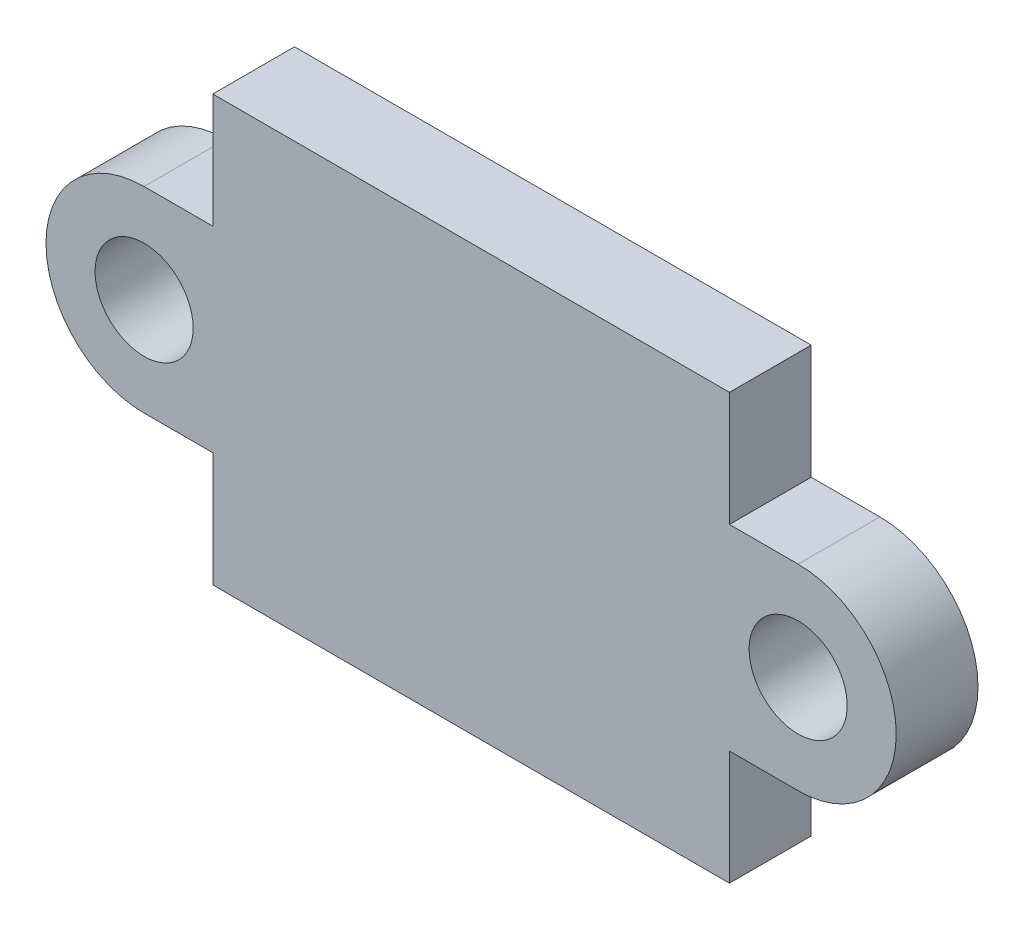
ISO-10303-21;
HEADER;
FILE_DESCRIPTION(('STEP AP214'),'2;1');
FILE_NAME('part.step','',(''),(''),'','','');
FILE_SCHEMA(('AUTOMOTIVE_DESIGN { 1 0 10303 214 1 1 1 1 }'));
ENDSEC;
DATA;
#1=APPLICATION_CONTEXT('core data for automotive mechanical design processes');
#2=APPLICATION_PROTOCOL_DEFINITION('international standard','automotive_design',2000,#1);
#3=PRODUCT_CONTEXT('',#1,'mechanical');
#4=PRODUCT('Part','Part','',(#3));
#5=PRODUCT_RELATED_PRODUCT_CATEGORY('part','',(#4));
#6=PRODUCT_DEFINITION_FORMATION('','',#4);
#7=PRODUCT_DEFINITION_CONTEXT('part definition',#1,'design');
#8=PRODUCT_DEFINITION('design','',#6,#7);
#9=PRODUCT_DEFINITION_SHAPE('','',#8);
#10=(LENGTH_UNIT() NAMED_UNIT(*) SI_UNIT(.MILLI.,.METRE.));
#11=(NAMED_UNIT(*) PLANE_ANGLE_UNIT() SI_UNIT($,.RADIAN.));
#12=(NAMED_UNIT(*) SI_UNIT($,.STERADIAN.) SOLID_ANGLE_UNIT());
#13=UNCERTAINTY_MEASURE_WITH_UNIT(LENGTH_MEASURE(1.E-05),#10,'distance_accuracy_value','');
#14=(GEOMETRIC_REPRESENTATION_CONTEXT(3) GLOBAL_UNCERTAINTY_ASSIGNED_CONTEXT((#13)) GLOBAL_UNIT_ASSIGNED_CONTEXT((#10,
#11,#12)) REPRESENTATION_CONTEXT('',''));
#15=CARTESIAN_POINT('',(0.,0.,0.));
#16=DIRECTION('',(0.,0.,1.));
#17=DIRECTION('',(1.,0.,0.));
#18=AXIS2_PLACEMENT_3D('',#15,#16,#17);
#19=CARTESIAN_POINT('',(-10.,0.,2.5));
#20=DIRECTION('',(0.,0.,1.));
#21=DIRECTION('',(1.,0.,0.));
#22=AXIS2_PLACEMENT_3D('',#19,#20,#21);
#23=PLANE('',#22);
#24=CARTESIAN_POINT('',(-10.,0.,2.5));
#25=DIRECTION('',(0.,0.,1.));
#26=DIRECTION('',(1.,0.,0.));
#27=AXIS2_PLACEMENT_3D('',#24,#25,#26);
#28=CIRCLE('',#27,1.5);
#29=CARTESIAN_POINT('',(-8.5,0.,2.5));
#30=VERTEX_POINT('',#29);
#31=EDGE_CURVE('E158',#30,#30,#28,.T.);
#32=ORIENTED_EDGE('',*,*,#31,.F.);
#33=EDGE_LOOP('',(#32));
#34=FACE_BOUND('',#33,.T.);
#35=CARTESIAN_POINT('',(-10.,0.,2.5));
#36=DIRECTION('',(0.,0.,1.));
#37=DIRECTION('',(1.,0.,0.));
#38=AXIS2_PLACEMENT_3D('',#35,#36,#37);
#39=CIRCLE('',#38,3.);
#40=CARTESIAN_POINT('',(-10.,3.,2.5));
#41=VERTEX_POINT('',#40);
#42=CARTESIAN_POINT('',(-10.,-3.,2.5));
#43=VERTEX_POINT('',#42);
#44=EDGE_CURVE('E177',#41,#43,#39,.T.);
#45=ORIENTED_EDGE('',*,*,#44,.T.);
#46=DIRECTION('',(1.,0.,0.));
#47=VECTOR('',#46,1.);
#48=CARTESIAN_POINT('',(-10.,-3.,2.5));
#49=LINE('',#48,#47);
#50=CARTESIAN_POINT('',(-7.9,-3.,2.5));
#51=VERTEX_POINT('',#50);
#52=EDGE_CURVE('E105',#43,#51,#49,.T.);
#53=ORIENTED_EDGE('',*,*,#52,.T.);
#54=DIRECTION('',(0.,-1.,0.));
#55=VECTOR('',#54,1.);
#56=CARTESIAN_POINT('',(-7.9,-3.,2.5));
#57=LINE('',#56,#55);
#58=CARTESIAN_POINT('',(-7.9,-6.5,2.5));
#59=VERTEX_POINT('',#58);
#60=EDGE_CURVE('E204',#51,#59,#57,.T.);
#61=ORIENTED_EDGE('',*,*,#60,.T.);
#62=DIRECTION('',(1.,0.,0.));
#63=VECTOR('',#62,1.);
#64=CARTESIAN_POINT('',(-7.9,-6.5,2.5));
#65=LINE('',#64,#63);
#66=CARTESIAN_POINT('',(7.9,-6.49999999999999,2.5));
#67=VERTEX_POINT('',#66);
#68=EDGE_CURVE('E223',#59,#67,#65,.T.);
#69=ORIENTED_EDGE('',*,*,#68,.T.);
#70=DIRECTION('',(0.,1.,0.));
#71=VECTOR('',#70,1.);
#72=CARTESIAN_POINT('',(7.9,-3.,2.5));
#73=LINE('',#72,#71);
#74=CARTESIAN_POINT('',(7.9,-3.,2.5));
#75=VERTEX_POINT('',#74);
#76=EDGE_CURVE('E220',#67,#75,#73,.T.);
#77=ORIENTED_EDGE('',*,*,#76,.T.);
#78=DIRECTION('',(1.,0.,0.));
#79=VECTOR('',#78,1.);
#80=CARTESIAN_POINT('',(10.,-3.,2.5));
#81=LINE('',#80,#79);
#82=CARTESIAN_POINT('',(10.,-3.,2.5));
#83=VERTEX_POINT('',#82);
#84=EDGE_CURVE('E222',#75,#83,#81,.T.);
#85=ORIENTED_EDGE('',*,*,#84,.T.);
#86=CARTESIAN_POINT('',(10.,0.,2.5));
#87=DIRECTION('',(0.,0.,1.));
#88=DIRECTION('',(-1.,0.,0.));
#89=AXIS2_PLACEMENT_3D('',#86,#87,#88);
#90=CIRCLE('',#89,3.);
#91=CARTESIAN_POINT('',(10.,3.,2.5));
#92=VERTEX_POINT('',#91);
#93=EDGE_CURVE('E225',#83,#92,#90,.T.);
#94=ORIENTED_EDGE('',*,*,#93,.T.);
#95=DIRECTION('',(-1.,0.,0.));
#96=VECTOR('',#95,1.);
#97=CARTESIAN_POINT('',(10.,3.,2.5));
#98=LINE('',#97,#96);
#99=CARTESIAN_POINT('',(7.9,3.,2.5));
#100=VERTEX_POINT('',#99);
#101=EDGE_CURVE('E231',#92,#100,#98,.T.);
#102=ORIENTED_EDGE('',*,*,#101,.T.);
#103=DIRECTION('',(0.,1.,0.));
#104=VECTOR('',#103,1.);
#105=CARTESIAN_POINT('',(7.9,3.,2.5));
#106=LINE('',#105,#104);
#107=CARTESIAN_POINT('',(7.9,6.50000000000001,2.5));
#108=VERTEX_POINT('',#107);
#109=EDGE_CURVE('E136',#100,#108,#106,.T.);
#110=ORIENTED_EDGE('',*,*,#109,.T.);
#111=DIRECTION('',(-1.,0.,0.));
#112=VECTOR('',#111,1.);
#113=CARTESIAN_POINT('',(-7.9,6.5,2.5));
#114=LINE('',#113,#112);
#115=CARTESIAN_POINT('',(-7.9,6.5,2.5));
#116=VERTEX_POINT('',#115);
#117=EDGE_CURVE('E130',#108,#116,#114,.T.);
#118=ORIENTED_EDGE('',*,*,#117,.T.);
#119=DIRECTION('',(0.,-1.,0.));
#120=VECTOR('',#119,1.);
#121=CARTESIAN_POINT('',(-7.9,3.,2.5));
#122=LINE('',#121,#120);
#123=CARTESIAN_POINT('',(-7.9,3.,2.5));
#124=VERTEX_POINT('',#123);
#125=EDGE_CURVE('E134',#116,#124,#122,.T.);
#126=ORIENTED_EDGE('',*,*,#125,.T.);
#127=DIRECTION('',(-1.,0.,0.));
#128=VECTOR('',#127,1.);
#129=CARTESIAN_POINT('',(-10.,3.,2.5));
#130=LINE('',#129,#128);
#131=EDGE_CURVE('E50',#124,#41,#130,.T.);
#132=ORIENTED_EDGE('',*,*,#131,.T.);
#133=EDGE_LOOP('',(#45,#53,#61,#69,#77,#85,#94,#102,#110,#118,#126,#132));
#134=FACE_BOUND('',#133,.T.);
#135=CARTESIAN_POINT('',(10.,0.,2.5));
#136=DIRECTION('',(0.,0.,1.));
#137=DIRECTION('',(-1.,0.,0.));
#138=AXIS2_PLACEMENT_3D('',#135,#136,#137);
#139=CIRCLE('',#138,1.5);
#140=CARTESIAN_POINT('',(8.5,0.,2.5));
#141=VERTEX_POINT('',#140);
#142=EDGE_CURVE('E273',#141,#141,#139,.T.);
#143=ORIENTED_EDGE('',*,*,#142,.F.);
#144=EDGE_LOOP('',(#143));
#145=FACE_BOUND('',#144,.T.);
#146=ADVANCED_FACE('F33',(#34,#134,#145),#23,.T.);
#147=CARTESIAN_POINT('',(-10.,0.,0.));
#148=DIRECTION('',(0.,0.,1.));
#149=DIRECTION('',(1.,0.,0.));
#150=AXIS2_PLACEMENT_3D('',#147,#148,#149);
#151=PLANE('',#150);
#152=CARTESIAN_POINT('',(-10.,0.,0.));
#153=DIRECTION('',(0.,0.,1.));
#154=DIRECTION('',(1.,0.,0.));
#155=AXIS2_PLACEMENT_3D('',#152,#153,#154);
#156=CIRCLE('',#155,3.);
#157=CARTESIAN_POINT('',(-10.,3.,0.));
#158=VERTEX_POINT('',#157);
#159=CARTESIAN_POINT('',(-10.,-3.,0.));
#160=VERTEX_POINT('',#159);
#161=EDGE_CURVE('E154',#158,#160,#156,.T.);
#162=ORIENTED_EDGE('',*,*,#161,.F.);
#163=DIRECTION('',(-1.,0.,0.));
#164=VECTOR('',#163,1.);
#165=CARTESIAN_POINT('',(-10.,3.,0.));
#166=LINE('',#165,#164);
#167=CARTESIAN_POINT('',(-7.9,3.,0.));
#168=VERTEX_POINT('',#167);
#169=EDGE_CURVE('E97',#168,#158,#166,.T.);
#170=ORIENTED_EDGE('',*,*,#169,.F.);
#171=DIRECTION('',(0.,-1.,0.));
#172=VECTOR('',#171,1.);
#173=CARTESIAN_POINT('',(-7.9,3.,0.));
#174=LINE('',#173,#172);
#175=CARTESIAN_POINT('',(-7.9,6.5,0.));
#176=VERTEX_POINT('',#175);
#177=EDGE_CURVE('E91',#176,#168,#174,.T.);
#178=ORIENTED_EDGE('',*,*,#177,.F.);
#179=DIRECTION('',(-1.,0.,0.));
#180=VECTOR('',#179,1.);
#181=CARTESIAN_POINT('',(-7.9,6.5,0.));
#182=LINE('',#181,#180);
#183=CARTESIAN_POINT('',(7.9,6.50000000000001,0.));
#184=VERTEX_POINT('',#183);
#185=EDGE_CURVE('E144',#184,#176,#182,.T.);
#186=ORIENTED_EDGE('',*,*,#185,.F.);
#187=DIRECTION('',(0.,1.,0.));
#188=VECTOR('',#187,1.);
#189=CARTESIAN_POINT('',(7.9,3.,0.));
#190=LINE('',#189,#188);
#191=CARTESIAN_POINT('',(7.9,3.,0.));
#192=VERTEX_POINT('',#191);
#193=EDGE_CURVE('E172',#192,#184,#190,.T.);
#194=ORIENTED_EDGE('',*,*,#193,.F.);
#195=DIRECTION('',(-1.,0.,0.));
#196=VECTOR('',#195,1.);
#197=CARTESIAN_POINT('',(10.,3.,0.));
#198=LINE('',#197,#196);
#199=CARTESIAN_POINT('',(10.,3.,0.));
#200=VERTEX_POINT('',#199);
#201=EDGE_CURVE('E170',#200,#192,#198,.T.);
#202=ORIENTED_EDGE('',*,*,#201,.F.);
#203=CARTESIAN_POINT('',(10.,0.,0.));
#204=DIRECTION('',(0.,0.,1.));
#205=DIRECTION('',(-1.,0.,0.));
#206=AXIS2_PLACEMENT_3D('',#203,#204,#205);
#207=CIRCLE('',#206,3.);
#208=CARTESIAN_POINT('',(10.,-3.,0.));
#209=VERTEX_POINT('',#208);
#210=EDGE_CURVE('E168',#209,#200,#207,.T.);
#211=ORIENTED_EDGE('',*,*,#210,.F.);
#212=DIRECTION('',(1.,0.,0.));
#213=VECTOR('',#212,1.);
#214=CARTESIAN_POINT('',(10.,-3.,0.));
#215=LINE('',#214,#213);
#216=CARTESIAN_POINT('',(7.9,-3.,0.));
#217=VERTEX_POINT('',#216);
#218=EDGE_CURVE('E166',#217,#209,#215,.T.);
#219=ORIENTED_EDGE('',*,*,#218,.F.);
#220=DIRECTION('',(0.,1.,0.));
#221=VECTOR('',#220,1.);
#222=CARTESIAN_POINT('',(7.9,-3.,0.));
#223=LINE('',#222,#221);
#224=CARTESIAN_POINT('',(7.9,-6.49999999999999,0.));
#225=VERTEX_POINT('',#224);
#226=EDGE_CURVE('E164',#225,#217,#223,.T.);
#227=ORIENTED_EDGE('',*,*,#226,.F.);
#228=DIRECTION('',(1.,0.,0.));
#229=VECTOR('',#228,1.);
#230=CARTESIAN_POINT('',(-7.9,-6.5,0.));
#231=LINE('',#230,#229);
#232=CARTESIAN_POINT('',(-7.9,-6.5,0.));
#233=VERTEX_POINT('',#232);
#234=EDGE_CURVE('E162',#233,#225,#231,.T.);
#235=ORIENTED_EDGE('',*,*,#234,.F.);
#236=DIRECTION('',(0.,-1.,0.));
#237=VECTOR('',#236,1.);
#238=CARTESIAN_POINT('',(-7.9,-3.,0.));
#239=LINE('',#238,#237);
#240=CARTESIAN_POINT('',(-7.9,-3.,0.));
#241=VERTEX_POINT('',#240);
#242=EDGE_CURVE('E160',#241,#233,#239,.T.);
#243=ORIENTED_EDGE('',*,*,#242,.F.);
#244=DIRECTION('',(1.,0.,0.));
#245=VECTOR('',#244,1.);
#246=CARTESIAN_POINT('',(-10.,-3.,0.));
#247=LINE('',#246,#245);
#248=EDGE_CURVE('E157',#160,#241,#247,.T.);
#249=ORIENTED_EDGE('',*,*,#248,.F.);
#250=EDGE_LOOP('',(#162,#170,#178,#186,#194,#202,#211,#219,#227,#235,#243,#249));
#251=FACE_BOUND('',#250,.T.);
#252=CARTESIAN_POINT('',(-10.,0.,0.));
#253=DIRECTION('',(0.,0.,1.));
#254=DIRECTION('',(1.,0.,0.));
#255=AXIS2_PLACEMENT_3D('',#252,#253,#254);
#256=CIRCLE('',#255,1.5);
#257=CARTESIAN_POINT('',(-8.5,0.,0.));
#258=VERTEX_POINT('',#257);
#259=EDGE_CURVE('E279',#258,#258,#256,.T.);
#260=ORIENTED_EDGE('',*,*,#259,.T.);
#261=EDGE_LOOP('',(#260));
#262=FACE_BOUND('',#261,.T.);
#263=CARTESIAN_POINT('',(10.,0.,0.));
#264=DIRECTION('',(0.,0.,1.));
#265=DIRECTION('',(-1.,0.,0.));
#266=AXIS2_PLACEMENT_3D('',#263,#264,#265);
#267=CIRCLE('',#266,1.5);
#268=CARTESIAN_POINT('',(8.5,0.,0.));
#269=VERTEX_POINT('',#268);
#270=EDGE_CURVE('E276',#269,#269,#267,.T.);
#271=ORIENTED_EDGE('',*,*,#270,.T.);
#272=EDGE_LOOP('',(#271));
#273=FACE_BOUND('',#272,.T.);
#274=ADVANCED_FACE('F208',(#251,#262,#273),#151,.F.);
#275=CARTESIAN_POINT('',(-10.,0.,2.5));
#276=DIRECTION('',(0.,0.,-1.));
#277=DIRECTION('',(-1.,0.,0.));
#278=AXIS2_PLACEMENT_3D('',#275,#276,#277);
#279=CYLINDRICAL_SURFACE('',#278,3.);
#280=ORIENTED_EDGE('',*,*,#161,.T.);
#281=DIRECTION('',(0.,0.,-1.));
#282=VECTOR('',#281,1.);
#283=CARTESIAN_POINT('',(-10.,-3.,2.5));
#284=LINE('',#283,#282);
#285=EDGE_CURVE('E11',#43,#160,#284,.T.);
#286=ORIENTED_EDGE('',*,*,#285,.F.);
#287=ORIENTED_EDGE('',*,*,#44,.F.);
#288=DIRECTION('',(0.,0.,-1.));
#289=VECTOR('',#288,1.);
#290=CARTESIAN_POINT('',(-10.,3.,2.5));
#291=LINE('',#290,#289);
#292=EDGE_CURVE('E150',#41,#158,#291,.T.);
#293=ORIENTED_EDGE('',*,*,#292,.T.);
#294=EDGE_LOOP('',(#280,#286,#287,#293));
#295=FACE_BOUND('',#294,.T.);
#296=ADVANCED_FACE('F35',(#295),#279,.T.);
#297=CARTESIAN_POINT('',(-10.,-3.,2.5));
#298=DIRECTION('',(0.,1.,0.));
#299=DIRECTION('',(0.,0.,1.));
#300=AXIS2_PLACEMENT_3D('',#297,#298,#299);
#301=PLANE('',#300);
#302=ORIENTED_EDGE('',*,*,#248,.T.);
#303=DIRECTION('',(0.,0.,-1.));
#304=VECTOR('',#303,1.);
#305=CARTESIAN_POINT('',(-7.9,-3.,2.5));
#306=LINE('',#305,#304);
#307=EDGE_CURVE('E42',#51,#241,#306,.T.);
#308=ORIENTED_EDGE('',*,*,#307,.F.);
#309=ORIENTED_EDGE('',*,*,#52,.F.);
#310=ORIENTED_EDGE('',*,*,#285,.T.);
#311=EDGE_LOOP('',(#302,#308,#309,#310));
#312=FACE_BOUND('',#311,.T.);
#313=ADVANCED_FACE('F372',(#312),#301,.F.);
#314=CARTESIAN_POINT('',(-7.9,-3.,2.5));
#315=DIRECTION('',(1.,0.,0.));
#316=DIRECTION('',(0.,0.,-1.));
#317=AXIS2_PLACEMENT_3D('',#314,#315,#316);
#318=PLANE('',#317);
#319=ORIENTED_EDGE('',*,*,#242,.T.);
#320=DIRECTION('',(0.,0.,-1.));
#321=VECTOR('',#320,1.);
#322=CARTESIAN_POINT('',(-7.9,-6.5,2.5));
#323=LINE('',#322,#321);
#324=EDGE_CURVE('E196',#59,#233,#323,.T.);
#325=ORIENTED_EDGE('',*,*,#324,.F.);
#326=ORIENTED_EDGE('',*,*,#60,.F.);
#327=ORIENTED_EDGE('',*,*,#307,.T.);
#328=EDGE_LOOP('',(#319,#325,#326,#327));
#329=FACE_BOUND('',#328,.T.);
#330=ADVANCED_FACE('F202',(#329),#318,.F.);
#331=CARTESIAN_POINT('',(-7.9,-6.5,2.5));
#332=DIRECTION('',(0.,1.,0.));
#333=DIRECTION('',(-1.,0.,0.));
#334=AXIS2_PLACEMENT_3D('',#331,#332,#333);
#335=PLANE('',#334);
#336=ORIENTED_EDGE('',*,*,#234,.T.);
#337=DIRECTION('',(0.,0.,-1.));
#338=VECTOR('',#337,1.);
#339=CARTESIAN_POINT('',(7.9,-6.49999999999999,2.5));
#340=LINE('',#339,#338);
#341=EDGE_CURVE('E193',#67,#225,#340,.T.);
#342=ORIENTED_EDGE('',*,*,#341,.F.);
#343=ORIENTED_EDGE('',*,*,#68,.F.);
#344=ORIENTED_EDGE('',*,*,#324,.T.);
#345=EDGE_LOOP('',(#336,#342,#343,#344));
#346=FACE_BOUND('',#345,.T.);
#347=ADVANCED_FACE('F214',(#346),#335,.F.);
#348=CARTESIAN_POINT('',(7.9,-3.,2.5));
#349=DIRECTION('',(-1.,0.,0.));
#350=DIRECTION('',(0.,-1.,0.));
#351=AXIS2_PLACEMENT_3D('',#348,#349,#350);
#352=PLANE('',#351);
#353=ORIENTED_EDGE('',*,*,#226,.T.);
#354=DIRECTION('',(0.,0.,-1.));
#355=VECTOR('',#354,1.);
#356=CARTESIAN_POINT('',(7.9,-3.,2.5));
#357=LINE('',#356,#355);
#358=EDGE_CURVE('E190',#75,#217,#357,.T.);
#359=ORIENTED_EDGE('',*,*,#358,.F.);
#360=ORIENTED_EDGE('',*,*,#76,.F.);
#361=ORIENTED_EDGE('',*,*,#341,.T.);
#362=EDGE_LOOP('',(#353,#359,#360,#361));
#363=FACE_BOUND('',#362,.T.);
#364=ADVANCED_FACE('F218',(#363),#352,.F.);
#365=CARTESIAN_POINT('',(10.,-3.,2.5));
#366=DIRECTION('',(0.,1.,0.));
#367=DIRECTION('',(-1.,0.,0.));
#368=AXIS2_PLACEMENT_3D('',#365,#366,#367);
#369=PLANE('',#368);
#370=ORIENTED_EDGE('',*,*,#218,.T.);
#371=DIRECTION('',(0.,0.,-1.));
#372=VECTOR('',#371,1.);
#373=CARTESIAN_POINT('',(10.,-3.,2.5));
#374=LINE('',#373,#372);
#375=EDGE_CURVE('E187',#83,#209,#374,.T.);
#376=ORIENTED_EDGE('',*,*,#375,.F.);
#377=ORIENTED_EDGE('',*,*,#84,.F.);
#378=ORIENTED_EDGE('',*,*,#358,.T.);
#379=EDGE_LOOP('',(#370,#376,#377,#378));
#380=FACE_BOUND('',#379,.T.);
#381=ADVANCED_FACE('F337',(#380),#369,.F.);
#382=CARTESIAN_POINT('',(10.,0.,2.5));
#383=DIRECTION('',(0.,0.,-1.));
#384=DIRECTION('',(-1.,0.,0.));
#385=AXIS2_PLACEMENT_3D('',#382,#383,#384);
#386=CYLINDRICAL_SURFACE('',#385,3.);
#387=ORIENTED_EDGE('',*,*,#210,.T.);
#388=DIRECTION('',(0.,0.,-1.));
#389=VECTOR('',#388,1.);
#390=CARTESIAN_POINT('',(10.,3.,2.5));
#391=LINE('',#390,#389);
#392=EDGE_CURVE('E184',#92,#200,#391,.T.);
#393=ORIENTED_EDGE('',*,*,#392,.F.);
#394=ORIENTED_EDGE('',*,*,#93,.F.);
#395=ORIENTED_EDGE('',*,*,#375,.T.);
#396=EDGE_LOOP('',(#387,#393,#394,#395));
#397=FACE_BOUND('',#396,.T.);
#398=ADVANCED_FACE('F328',(#397),#386,.T.);
#399=CARTESIAN_POINT('',(10.,3.,2.5));
#400=DIRECTION('',(0.,-1.,0.));
#401=DIRECTION('',(1.,0.,0.));
#402=AXIS2_PLACEMENT_3D('',#399,#400,#401);
#403=PLANE('',#402);
#404=ORIENTED_EDGE('',*,*,#201,.T.);
#405=DIRECTION('',(0.,0.,-1.));
#406=VECTOR('',#405,1.);
#407=CARTESIAN_POINT('',(7.9,3.,2.5));
#408=LINE('',#407,#406);
#409=EDGE_CURVE('E181',#100,#192,#408,.T.);
#410=ORIENTED_EDGE('',*,*,#409,.F.);
#411=ORIENTED_EDGE('',*,*,#101,.F.);
#412=ORIENTED_EDGE('',*,*,#392,.T.);
#413=EDGE_LOOP('',(#404,#410,#411,#412));
#414=FACE_BOUND('',#413,.T.);
#415=ADVANCED_FACE('F237',(#414),#403,.F.);
#416=CARTESIAN_POINT('',(7.9,3.,2.5));
#417=DIRECTION('',(-1.,0.,0.));
#418=DIRECTION('',(0.,-1.,0.));
#419=AXIS2_PLACEMENT_3D('',#416,#417,#418);
#420=PLANE('',#419);
#421=ORIENTED_EDGE('',*,*,#193,.T.);
#422=DIRECTION('',(0.,0.,-1.));
#423=VECTOR('',#422,1.);
#424=CARTESIAN_POINT('',(7.9,6.50000000000001,2.5));
#425=LINE('',#424,#423);
#426=EDGE_CURVE('E145',#108,#184,#425,.T.);
#427=ORIENTED_EDGE('',*,*,#426,.F.);
#428=ORIENTED_EDGE('',*,*,#109,.F.);
#429=ORIENTED_EDGE('',*,*,#409,.T.);
#430=EDGE_LOOP('',(#421,#427,#428,#429));
#431=FACE_BOUND('',#430,.T.);
#432=ADVANCED_FACE('F241',(#431),#420,.F.);
#433=CARTESIAN_POINT('',(-7.9,6.5,2.5));
#434=DIRECTION('',(0.,-1.,0.));
#435=DIRECTION('',(1.,0.,0.));
#436=AXIS2_PLACEMENT_3D('',#433,#434,#435);
#437=PLANE('',#436);
#438=ORIENTED_EDGE('',*,*,#185,.T.);
#439=DIRECTION('',(0.,0.,-1.));
#440=VECTOR('',#439,1.);
#441=CARTESIAN_POINT('',(-7.9,6.5,2.5));
#442=LINE('',#441,#440);
#443=EDGE_CURVE('E141',#116,#176,#442,.T.);
#444=ORIENTED_EDGE('',*,*,#443,.F.);
#445=ORIENTED_EDGE('',*,*,#117,.F.);
#446=ORIENTED_EDGE('',*,*,#426,.T.);
#447=EDGE_LOOP('',(#438,#444,#445,#446));
#448=FACE_BOUND('',#447,.T.);
#449=ADVANCED_FACE('F142',(#448),#437,.F.);
#450=CARTESIAN_POINT('',(-7.9,3.,2.5));
#451=DIRECTION('',(1.,0.,0.));
#452=DIRECTION('',(0.,0.,-1.));
#453=AXIS2_PLACEMENT_3D('',#450,#451,#452);
#454=PLANE('',#453);
#455=ORIENTED_EDGE('',*,*,#177,.T.);
#456=DIRECTION('',(0.,0.,-1.));
#457=VECTOR('',#456,1.);
#458=CARTESIAN_POINT('',(-7.9,3.,2.5));
#459=LINE('',#458,#457);
#460=EDGE_CURVE('E146',#124,#168,#459,.T.);
#461=ORIENTED_EDGE('',*,*,#460,.F.);
#462=ORIENTED_EDGE('',*,*,#125,.F.);
#463=ORIENTED_EDGE('',*,*,#443,.T.);
#464=EDGE_LOOP('',(#455,#461,#462,#463));
#465=FACE_BOUND('',#464,.T.);
#466=ADVANCED_FACE('F148',(#465),#454,.F.);
#467=CARTESIAN_POINT('',(-10.,3.,2.5));
#468=DIRECTION('',(0.,-1.,0.));
#469=DIRECTION('',(0.,0.,-1.));
#470=AXIS2_PLACEMENT_3D('',#467,#468,#469);
#471=PLANE('',#470);
#472=ORIENTED_EDGE('',*,*,#169,.T.);
#473=ORIENTED_EDGE('',*,*,#292,.F.);
#474=ORIENTED_EDGE('',*,*,#131,.F.);
#475=ORIENTED_EDGE('',*,*,#460,.T.);
#476=EDGE_LOOP('',(#472,#473,#474,#475));
#477=FACE_BOUND('',#476,.T.);
#478=ADVANCED_FACE('F245',(#477),#471,.F.);
#479=CARTESIAN_POINT('',(-10.,0.,2.5));
#480=DIRECTION('',(0.,0.,-1.));
#481=DIRECTION('',(-1.,0.,0.));
#482=AXIS2_PLACEMENT_3D('',#479,#480,#481);
#483=CYLINDRICAL_SURFACE('',#482,1.5);
#484=ORIENTED_EDGE('',*,*,#31,.T.);
#485=EDGE_LOOP('',(#484));
#486=FACE_BOUND('',#485,.T.);
#487=ORIENTED_EDGE('',*,*,#259,.F.);
#488=EDGE_LOOP('',(#487));
#489=FACE_BOUND('',#488,.T.);
#490=ADVANCED_FACE('F247',(#486,#489),#483,.F.);
#491=CARTESIAN_POINT('',(10.,0.,2.5));
#492=DIRECTION('',(0.,0.,-1.));
#493=DIRECTION('',(-1.,0.,0.));
#494=AXIS2_PLACEMENT_3D('',#491,#492,#493);
#495=CYLINDRICAL_SURFACE('',#494,1.5);
#496=ORIENTED_EDGE('',*,*,#142,.T.);
#497=EDGE_LOOP('',(#496));
#498=FACE_BOUND('',#497,.T.);
#499=ORIENTED_EDGE('',*,*,#270,.F.);
#500=EDGE_LOOP('',(#499));
#501=FACE_BOUND('',#500,.T.);
#502=ADVANCED_FACE('F253',(#498,#501),#495,.F.);
#503=CLOSED_SHELL('',(#146,#274,#296,#313,#330,#347,#364,#381,#398,#415,#432,#449,#466,#478,
#490,#502));
#504=MANIFOLD_SOLID_BREP('B2',#503);
#505=ADVANCED_BREP_SHAPE_REPRESENTATION('',(#18,#504),#14);
#506=SHAPE_DEFINITION_REPRESENTATION(#9,#505);
ENDSEC;
END-ISO-10303-21;
